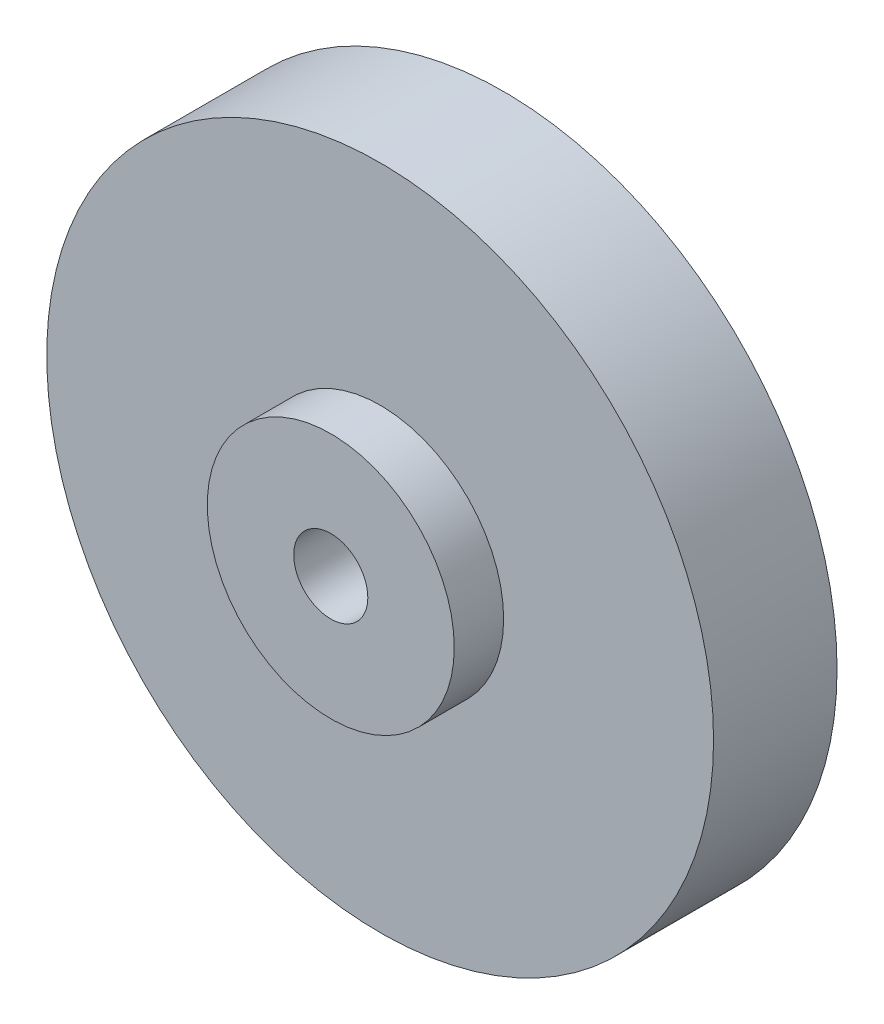
ISO-10303-21;
HEADER;
FILE_DESCRIPTION(('STEP AP214'),'2;1');
FILE_NAME('part.step','',(''),(''),'','','');
FILE_SCHEMA(('AUTOMOTIVE_DESIGN { 1 0 10303 214 1 1 1 1 }'));
ENDSEC;
DATA;
#1=APPLICATION_CONTEXT('core data for automotive mechanical design processes');
#2=APPLICATION_PROTOCOL_DEFINITION('international standard','automotive_design',2000,#1);
#3=PRODUCT_CONTEXT('',#1,'mechanical');
#4=PRODUCT('Part','Part','',(#3));
#5=PRODUCT_RELATED_PRODUCT_CATEGORY('part','',(#4));
#6=PRODUCT_DEFINITION_FORMATION('','',#4);
#7=PRODUCT_DEFINITION_CONTEXT('part definition',#1,'design');
#8=PRODUCT_DEFINITION('design','',#6,#7);
#9=PRODUCT_DEFINITION_SHAPE('','',#8);
#10=(LENGTH_UNIT() NAMED_UNIT(*) SI_UNIT(.MILLI.,.METRE.));
#11=(NAMED_UNIT(*) PLANE_ANGLE_UNIT() SI_UNIT($,.RADIAN.));
#12=(NAMED_UNIT(*) SI_UNIT($,.STERADIAN.) SOLID_ANGLE_UNIT());
#13=UNCERTAINTY_MEASURE_WITH_UNIT(LENGTH_MEASURE(1.E-05),#10,'distance_accuracy_value','');
#14=(GEOMETRIC_REPRESENTATION_CONTEXT(3) GLOBAL_UNCERTAINTY_ASSIGNED_CONTEXT((#13)) GLOBAL_UNIT_ASSIGNED_CONTEXT((#10,
#11,#12)) REPRESENTATION_CONTEXT('',''));
#15=CARTESIAN_POINT('',(0.,0.,0.));
#16=DIRECTION('',(0.,0.,1.));
#17=DIRECTION('',(1.,0.,0.));
#18=AXIS2_PLACEMENT_3D('',#15,#16,#17);
#19=CARTESIAN_POINT('',(0.,0.,5.));
#20=DIRECTION('',(0.,0.,-1.));
#21=DIRECTION('',(-1.,0.,0.));
#22=AXIS2_PLACEMENT_3D('',#19,#20,#21);
#23=CYLINDRICAL_SURFACE('',#22,13.5);
#24=CARTESIAN_POINT('',(0.,0.,5.));
#25=DIRECTION('',(0.,0.,1.));
#26=DIRECTION('',(1.,0.,0.));
#27=AXIS2_PLACEMENT_3D('',#24,#25,#26);
#28=CIRCLE('',#27,13.5);
#29=CARTESIAN_POINT('',(13.5,0.,5.));
#30=VERTEX_POINT('',#29);
#31=EDGE_CURVE('E53',#30,#30,#28,.T.);
#32=ORIENTED_EDGE('',*,*,#31,.F.);
#33=EDGE_LOOP('',(#32));
#34=FACE_BOUND('',#33,.T.);
#35=CARTESIAN_POINT('',(0.,0.,0.));
#36=DIRECTION('',(0.,0.,1.));
#37=DIRECTION('',(1.,0.,0.));
#38=AXIS2_PLACEMENT_3D('',#35,#36,#37);
#39=CIRCLE('',#38,13.5);
#40=CARTESIAN_POINT('',(13.5,0.,0.));
#41=VERTEX_POINT('',#40);
#42=EDGE_CURVE('E56',#41,#41,#39,.T.);
#43=ORIENTED_EDGE('',*,*,#42,.T.);
#44=EDGE_LOOP('',(#43));
#45=FACE_BOUND('',#44,.T.);
#46=ADVANCED_FACE('F37',(#34,#45),#23,.T.);
#47=CARTESIAN_POINT('',(0.,0.,5.));
#48=DIRECTION('',(0.,0.,1.));
#49=DIRECTION('',(1.,0.,0.));
#50=AXIS2_PLACEMENT_3D('',#47,#48,#49);
#51=PLANE('',#50);
#52=CARTESIAN_POINT('',(0.,0.,5.));
#53=DIRECTION('',(0.,0.,1.));
#54=DIRECTION('',(1.,0.,0.));
#55=AXIS2_PLACEMENT_3D('',#52,#53,#54);
#56=CIRCLE('',#55,5.);
#57=CARTESIAN_POINT('',(5.,0.,5.));
#58=VERTEX_POINT('',#57);
#59=EDGE_CURVE('E49',#58,#58,#56,.T.);
#60=ORIENTED_EDGE('',*,*,#59,.F.);
#61=EDGE_LOOP('',(#60));
#62=FACE_BOUND('',#61,.T.);
#63=ORIENTED_EDGE('',*,*,#31,.T.);
#64=EDGE_LOOP('',(#63));
#65=FACE_BOUND('',#64,.T.);
#66=ADVANCED_FACE('F83',(#62,#65),#51,.T.);
#67=CARTESIAN_POINT('',(0.,0.,0.));
#68=DIRECTION('',(0.,0.,1.));
#69=DIRECTION('',(1.,0.,0.));
#70=AXIS2_PLACEMENT_3D('',#67,#68,#69);
#71=PLANE('',#70);
#72=CARTESIAN_POINT('',(0.,0.,0.));
#73=DIRECTION('',(0.,0.,1.));
#74=DIRECTION('',(1.,0.,0.));
#75=AXIS2_PLACEMENT_3D('',#72,#73,#74);
#76=CIRCLE('',#75,3.5);
#77=CARTESIAN_POINT('',(3.5,0.,0.));
#78=VERTEX_POINT('',#77);
#79=EDGE_CURVE('E45',#78,#78,#76,.T.);
#80=ORIENTED_EDGE('',*,*,#79,.T.);
#81=EDGE_LOOP('',(#80));
#82=FACE_BOUND('',#81,.T.);
#83=ORIENTED_EDGE('',*,*,#42,.F.);
#84=EDGE_LOOP('',(#83));
#85=FACE_BOUND('',#84,.T.);
#86=ADVANCED_FACE('F79',(#82,#85),#71,.F.);
#87=CARTESIAN_POINT('',(0.,0.,7.));
#88=DIRECTION('',(0.,0.,-1.));
#89=DIRECTION('',(-1.,0.,0.));
#90=AXIS2_PLACEMENT_3D('',#87,#88,#89);
#91=CYLINDRICAL_SURFACE('',#90,5.);
#92=CARTESIAN_POINT('',(0.,0.,7.));
#93=DIRECTION('',(0.,0.,1.));
#94=DIRECTION('',(1.,0.,0.));
#95=AXIS2_PLACEMENT_3D('',#92,#93,#94);
#96=CIRCLE('',#95,5.);
#97=CARTESIAN_POINT('',(5.,0.,7.));
#98=VERTEX_POINT('',#97);
#99=EDGE_CURVE('E59',#98,#98,#96,.T.);
#100=ORIENTED_EDGE('',*,*,#99,.F.);
#101=EDGE_LOOP('',(#100));
#102=FACE_BOUND('',#101,.T.);
#103=ORIENTED_EDGE('',*,*,#59,.T.);
#104=EDGE_LOOP('',(#103));
#105=FACE_BOUND('',#104,.T.);
#106=ADVANCED_FACE('F73',(#102,#105),#91,.T.);
#107=CARTESIAN_POINT('',(0.,0.,7.));
#108=DIRECTION('',(0.,0.,1.));
#109=DIRECTION('',(1.,0.,0.));
#110=AXIS2_PLACEMENT_3D('',#107,#108,#109);
#111=PLANE('',#110);
#112=CARTESIAN_POINT('',(0.,0.,7.));
#113=DIRECTION('',(0.,0.,1.));
#114=DIRECTION('',(1.,0.,0.));
#115=AXIS2_PLACEMENT_3D('',#112,#113,#114);
#116=CIRCLE('',#115,1.5);
#117=CARTESIAN_POINT('',(1.5,0.,7.));
#118=VERTEX_POINT('',#117);
#119=EDGE_CURVE('E64',#118,#118,#116,.T.);
#120=ORIENTED_EDGE('',*,*,#119,.F.);
#121=EDGE_LOOP('',(#120));
#122=FACE_BOUND('',#121,.T.);
#123=ORIENTED_EDGE('',*,*,#99,.T.);
#124=EDGE_LOOP('',(#123));
#125=FACE_BOUND('',#124,.T.);
#126=ADVANCED_FACE('F70',(#122,#125),#111,.T.);
#127=CARTESIAN_POINT('',(0.,0.,0.));
#128=DIRECTION('',(0.,0.,1.));
#129=DIRECTION('',(1.,0.,0.));
#130=AXIS2_PLACEMENT_3D('',#127,#128,#129);
#131=CYLINDRICAL_SURFACE('',#130,1.5);
#132=CARTESIAN_POINT('',(0.,0.,2.00000000000001));
#133=DIRECTION('',(0.,0.,1.));
#134=DIRECTION('',(1.,0.,0.));
#135=AXIS2_PLACEMENT_3D('',#132,#133,#134);
#136=CIRCLE('',#135,1.5);
#137=CARTESIAN_POINT('',(1.5,0.,2.00000000000001));
#138=VERTEX_POINT('',#137);
#139=EDGE_CURVE('E10',#138,#138,#136,.F.);
#140=ORIENTED_EDGE('',*,*,#139,.T.);
#141=EDGE_LOOP('',(#140));
#142=FACE_BOUND('',#141,.T.);
#143=ORIENTED_EDGE('',*,*,#119,.T.);
#144=EDGE_LOOP('',(#143));
#145=FACE_BOUND('',#144,.T.);
#146=ADVANCED_FACE('F68',(#142,#145),#131,.F.);
#147=CARTESIAN_POINT('',(0.,0.,0.));
#148=DIRECTION('',(0.,0.,-1.));
#149=DIRECTION('',(-1.,0.,0.));
#150=AXIS2_PLACEMENT_3D('',#147,#148,#149);
#151=CONICAL_SURFACE('',#150,3.5,0.785398163397447);
#152=ORIENTED_EDGE('',*,*,#139,.F.);
#153=EDGE_LOOP('',(#152));
#154=FACE_BOUND('',#153,.T.);
#155=ORIENTED_EDGE('',*,*,#79,.F.);
#156=EDGE_LOOP('',(#155));
#157=FACE_BOUND('',#156,.T.);
#158=ADVANCED_FACE('F40',(#154,#157),#151,.F.);
#159=CLOSED_SHELL('',(#46,#66,#86,#106,#126,#146,#158));
#160=MANIFOLD_SOLID_BREP('B2',#159);
#161=ADVANCED_BREP_SHAPE_REPRESENTATION('',(#18,#160),#14);
#162=SHAPE_DEFINITION_REPRESENTATION(#9,#161);
ENDSEC;
END-ISO-10303-21;
